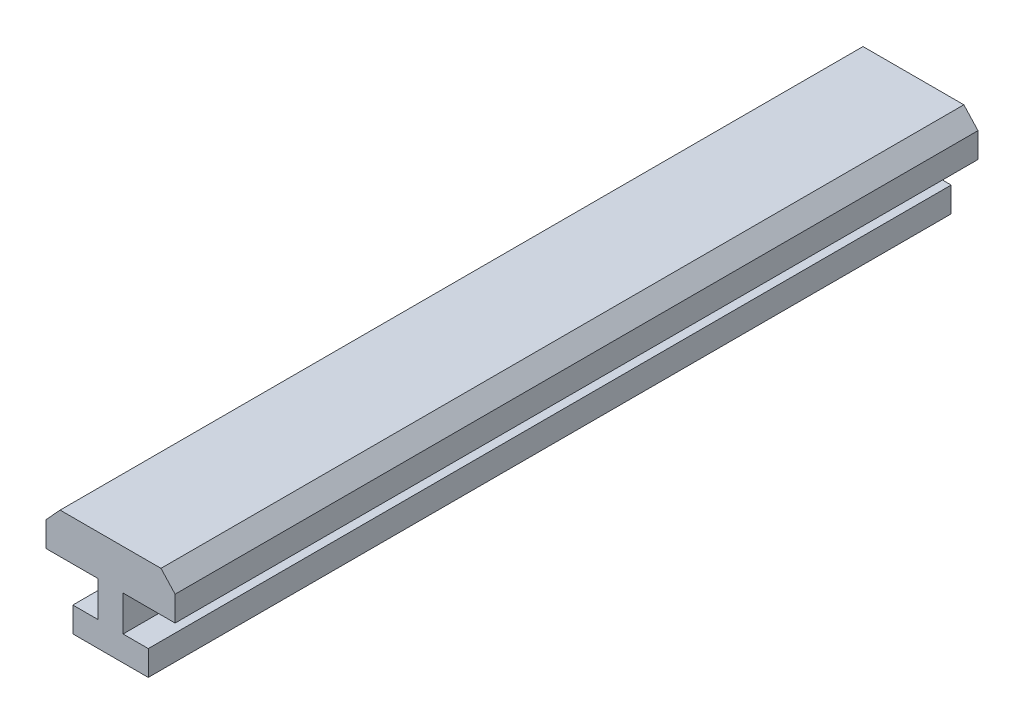
ISO-10303-21;
HEADER;
FILE_DESCRIPTION(('STEP AP214'),'2;1');
FILE_NAME('part.step','',(''),(''),'','','');
FILE_SCHEMA(('AUTOMOTIVE_DESIGN { 1 0 10303 214 1 1 1 1 }'));
ENDSEC;
DATA;
#1=APPLICATION_CONTEXT('core data for automotive mechanical design processes');
#2=APPLICATION_PROTOCOL_DEFINITION('international standard','automotive_design',2000,#1);
#3=PRODUCT_CONTEXT('',#1,'mechanical');
#4=PRODUCT('Part','Part','',(#3));
#5=PRODUCT_RELATED_PRODUCT_CATEGORY('part','',(#4));
#6=PRODUCT_DEFINITION_FORMATION('','',#4);
#7=PRODUCT_DEFINITION_CONTEXT('part definition',#1,'design');
#8=PRODUCT_DEFINITION('design','',#6,#7);
#9=PRODUCT_DEFINITION_SHAPE('','',#8);
#10=(LENGTH_UNIT() NAMED_UNIT(*) SI_UNIT(.MILLI.,.METRE.));
#11=(NAMED_UNIT(*) PLANE_ANGLE_UNIT() SI_UNIT($,.RADIAN.));
#12=(NAMED_UNIT(*) SI_UNIT($,.STERADIAN.) SOLID_ANGLE_UNIT());
#13=UNCERTAINTY_MEASURE_WITH_UNIT(LENGTH_MEASURE(1.E-05),#10,'distance_accuracy_value','');
#14=(GEOMETRIC_REPRESENTATION_CONTEXT(3) GLOBAL_UNCERTAINTY_ASSIGNED_CONTEXT((#13)) GLOBAL_UNIT_ASSIGNED_CONTEXT((#10,
#11,#12)) REPRESENTATION_CONTEXT('',''));
#15=CARTESIAN_POINT('',(0.,0.,0.));
#16=DIRECTION('',(0.,0.,1.));
#17=DIRECTION('',(1.,0.,0.));
#18=AXIS2_PLACEMENT_3D('',#15,#16,#17);
#19=CARTESIAN_POINT('',(1.77,0.,-19.9));
#20=DIRECTION('',(1.,0.,0.));
#21=DIRECTION('',(0.,0.,-1.));
#22=AXIS2_PLACEMENT_3D('',#19,#20,#21);
#23=PLANE('',#22);
#24=DIRECTION('',(0.,0.,-1.));
#25=VECTOR('',#24,1.);
#26=CARTESIAN_POINT('',(1.77,0.,-19.9));
#27=LINE('',#26,#25);
#28=CARTESIAN_POINT('',(1.77,0.,-19.9));
#29=VERTEX_POINT('',#28);
#30=CARTESIAN_POINT('',(1.77,0.,19.9));
#31=VERTEX_POINT('',#30);
#32=EDGE_CURVE('E171',#29,#31,#27,.F.);
#33=ORIENTED_EDGE('',*,*,#32,.F.);
#34=DIRECTION('',(0.,1.,0.));
#35=VECTOR('',#34,1.);
#36=CARTESIAN_POINT('',(1.77,0.,-19.9));
#37=LINE('',#36,#35);
#38=CARTESIAN_POINT('',(1.77,1.24,-19.9));
#39=VERTEX_POINT('',#38);
#40=EDGE_CURVE('E113',#29,#39,#37,.T.);
#41=ORIENTED_EDGE('',*,*,#40,.T.);
#42=DIRECTION('',(0.,0.,1.));
#43=VECTOR('',#42,1.);
#44=CARTESIAN_POINT('',(1.77,1.24,-19.9));
#45=LINE('',#44,#43);
#46=CARTESIAN_POINT('',(1.77,1.24,19.9));
#47=VERTEX_POINT('',#46);
#48=EDGE_CURVE('E128',#47,#39,#45,.F.);
#49=ORIENTED_EDGE('',*,*,#48,.F.);
#50=DIRECTION('',(0.,1.,0.));
#51=VECTOR('',#50,1.);
#52=CARTESIAN_POINT('',(1.77,0.,19.9));
#53=LINE('',#52,#51);
#54=EDGE_CURVE('E17',#47,#31,#53,.F.);
#55=ORIENTED_EDGE('',*,*,#54,.T.);
#56=EDGE_LOOP('',(#33,#41,#49,#55));
#57=FACE_BOUND('',#56,.T.);
#58=ADVANCED_FACE('F14',(#57),#23,.T.);
#59=CARTESIAN_POINT('',(-1.97,1.24,-19.9));
#60=DIRECTION('',(-1.,0.,0.));
#61=DIRECTION('',(0.,0.,1.));
#62=AXIS2_PLACEMENT_3D('',#59,#60,#61);
#63=PLANE('',#62);
#64=DIRECTION('',(0.,0.,1.));
#65=VECTOR('',#64,1.);
#66=CARTESIAN_POINT('',(-1.97,1.24,-19.9));
#67=LINE('',#66,#65);
#68=CARTESIAN_POINT('',(-1.97,1.24,-19.9));
#69=VERTEX_POINT('',#68);
#70=CARTESIAN_POINT('',(-1.97,1.24,19.9));
#71=VERTEX_POINT('',#70);
#72=EDGE_CURVE('E147',#69,#71,#67,.T.);
#73=ORIENTED_EDGE('',*,*,#72,.F.);
#74=DIRECTION('',(0.,1.,0.));
#75=VECTOR('',#74,1.);
#76=CARTESIAN_POINT('',(-1.97,1.24,-19.9));
#77=LINE('',#76,#75);
#78=CARTESIAN_POINT('',(-1.97,0.,-19.9));
#79=VERTEX_POINT('',#78);
#80=EDGE_CURVE('E136',#69,#79,#77,.F.);
#81=ORIENTED_EDGE('',*,*,#80,.T.);
#82=DIRECTION('',(0.,0.,-1.));
#83=VECTOR('',#82,1.);
#84=CARTESIAN_POINT('',(-1.97,0.,-19.9));
#85=LINE('',#84,#83);
#86=CARTESIAN_POINT('',(-1.97,0.,19.9));
#87=VERTEX_POINT('',#86);
#88=EDGE_CURVE('E150',#87,#79,#85,.T.);
#89=ORIENTED_EDGE('',*,*,#88,.F.);
#90=DIRECTION('',(0.,1.,0.));
#91=VECTOR('',#90,1.);
#92=CARTESIAN_POINT('',(-1.97,1.24,19.9));
#93=LINE('',#92,#91);
#94=EDGE_CURVE('E138',#87,#71,#93,.T.);
#95=ORIENTED_EDGE('',*,*,#94,.T.);
#96=EDGE_LOOP('',(#73,#81,#89,#95));
#97=FACE_BOUND('',#96,.T.);
#98=ADVANCED_FACE('F145',(#97),#63,.T.);
#99=CARTESIAN_POINT('',(1.77,1.24,-19.9));
#100=DIRECTION('',(0.,1.,0.));
#101=DIRECTION('',(0.,0.,1.));
#102=AXIS2_PLACEMENT_3D('',#99,#100,#101);
#103=PLANE('',#102);
#104=ORIENTED_EDGE('',*,*,#48,.T.);
#105=DIRECTION('',(1.,0.,0.));
#106=VECTOR('',#105,1.);
#107=CARTESIAN_POINT('',(1.77,1.24,-19.9));
#108=LINE('',#107,#106);
#109=CARTESIAN_POINT('',(0.519999999999997,1.24,-19.9));
#110=VERTEX_POINT('',#109);
#111=EDGE_CURVE('E130',#39,#110,#108,.F.);
#112=ORIENTED_EDGE('',*,*,#111,.T.);
#113=DIRECTION('',(0.,0.,-1.));
#114=VECTOR('',#113,1.);
#115=CARTESIAN_POINT('',(0.519999999999998,1.24,-19.9));
#116=LINE('',#115,#114);
#117=CARTESIAN_POINT('',(0.519999999999997,1.24,19.9));
#118=VERTEX_POINT('',#117);
#119=EDGE_CURVE('E134',#118,#110,#116,.T.);
#120=ORIENTED_EDGE('',*,*,#119,.F.);
#121=DIRECTION('',(1.,0.,0.));
#122=VECTOR('',#121,1.);
#123=CARTESIAN_POINT('',(1.77,1.24,19.9));
#124=LINE('',#123,#122);
#125=EDGE_CURVE('E122',#118,#47,#124,.T.);
#126=ORIENTED_EDGE('',*,*,#125,.T.);
#127=EDGE_LOOP('',(#104,#112,#120,#126));
#128=FACE_BOUND('',#127,.T.);
#129=ADVANCED_FACE('F132',(#128),#103,.T.);
#130=CARTESIAN_POINT('',(-0.72,1.24,-19.9));
#131=DIRECTION('',(0.,1.,0.));
#132=DIRECTION('',(0.,0.,1.));
#133=AXIS2_PLACEMENT_3D('',#130,#131,#132);
#134=PLANE('',#133);
#135=DIRECTION('',(0.,0.,1.));
#136=VECTOR('',#135,1.);
#137=CARTESIAN_POINT('',(-0.72,1.24,-19.9));
#138=LINE('',#137,#136);
#139=CARTESIAN_POINT('',(-0.72,1.24,-19.9));
#140=VERTEX_POINT('',#139);
#141=CARTESIAN_POINT('',(-0.72,1.24,19.9));
#142=VERTEX_POINT('',#141);
#143=EDGE_CURVE('E183',#140,#142,#138,.T.);
#144=ORIENTED_EDGE('',*,*,#143,.F.);
#145=DIRECTION('',(1.,0.,0.));
#146=VECTOR('',#145,1.);
#147=CARTESIAN_POINT('',(-0.72,1.24,-19.9));
#148=LINE('',#147,#146);
#149=EDGE_CURVE('E159',#140,#69,#148,.F.);
#150=ORIENTED_EDGE('',*,*,#149,.T.);
#151=ORIENTED_EDGE('',*,*,#72,.T.);
#152=DIRECTION('',(1.,0.,0.));
#153=VECTOR('',#152,1.);
#154=CARTESIAN_POINT('',(-0.72,1.24,19.9));
#155=LINE('',#154,#153);
#156=EDGE_CURVE('E152',#71,#142,#155,.T.);
#157=ORIENTED_EDGE('',*,*,#156,.T.);
#158=EDGE_LOOP('',(#144,#150,#151,#157));
#159=FACE_BOUND('',#158,.T.);
#160=ADVANCED_FACE('F161',(#159),#134,.T.);
#161=CARTESIAN_POINT('',(-3.3,4.24000000000002,-19.9));
#162=DIRECTION('',(-1.,0.,0.));
#163=DIRECTION('',(0.,-1.,0.));
#164=AXIS2_PLACEMENT_3D('',#161,#162,#163);
#165=PLANE('',#164);
#166=DIRECTION('',(0.,0.,1.));
#167=VECTOR('',#166,1.);
#168=CARTESIAN_POINT('',(-3.3,4.24000000000002,-19.9));
#169=LINE('',#168,#167);
#170=CARTESIAN_POINT('',(-3.3,4.24000000000001,-19.9));
#171=VERTEX_POINT('',#170);
#172=CARTESIAN_POINT('',(-3.3,4.24000000000001,19.9));
#173=VERTEX_POINT('',#172);
#174=EDGE_CURVE('E188',#171,#173,#169,.T.);
#175=ORIENTED_EDGE('',*,*,#174,.F.);
#176=DIRECTION('',(0.,-1.,0.));
#177=VECTOR('',#176,1.);
#178=CARTESIAN_POINT('',(-3.3,4.24000000000002,-19.9));
#179=LINE('',#178,#177);
#180=CARTESIAN_POINT('',(-3.3,3.,-19.9));
#181=VERTEX_POINT('',#180);
#182=EDGE_CURVE('E167',#171,#181,#179,.T.);
#183=ORIENTED_EDGE('',*,*,#182,.T.);
#184=DIRECTION('',(0.,0.,-1.));
#185=VECTOR('',#184,1.);
#186=CARTESIAN_POINT('',(-3.3,3.,-19.9));
#187=LINE('',#186,#185);
#188=CARTESIAN_POINT('',(-3.3,3.,19.9));
#189=VERTEX_POINT('',#188);
#190=EDGE_CURVE('E180',#189,#181,#187,.T.);
#191=ORIENTED_EDGE('',*,*,#190,.F.);
#192=DIRECTION('',(0.,-1.,0.));
#193=VECTOR('',#192,1.);
#194=CARTESIAN_POINT('',(-3.3,4.24000000000002,19.9));
#195=LINE('',#194,#193);
#196=EDGE_CURVE('E165',#189,#173,#195,.F.);
#197=ORIENTED_EDGE('',*,*,#196,.T.);
#198=EDGE_LOOP('',(#175,#183,#191,#197));
#199=FACE_BOUND('',#198,.T.);
#200=ADVANCED_FACE('F257',(#199),#165,.T.);
#201=CARTESIAN_POINT('',(3.1,3.,-19.9));
#202=DIRECTION('',(1.,0.,0.));
#203=DIRECTION('',(0.,1.,0.));
#204=AXIS2_PLACEMENT_3D('',#201,#202,#203);
#205=PLANE('',#204);
#206=DIRECTION('',(0.,0.,1.));
#207=VECTOR('',#206,1.);
#208=CARTESIAN_POINT('',(3.1,3.,-19.9));
#209=LINE('',#208,#207);
#210=CARTESIAN_POINT('',(3.1,3.,-19.9));
#211=VERTEX_POINT('',#210);
#212=CARTESIAN_POINT('',(3.1,3.,19.9));
#213=VERTEX_POINT('',#212);
#214=EDGE_CURVE('E175',#211,#213,#209,.T.);
#215=ORIENTED_EDGE('',*,*,#214,.F.);
#216=DIRECTION('',(0.,1.,0.));
#217=VECTOR('',#216,1.);
#218=CARTESIAN_POINT('',(3.1,3.,-19.9));
#219=LINE('',#218,#217);
#220=CARTESIAN_POINT('',(3.1,4.24000000000001,-19.9));
#221=VERTEX_POINT('',#220);
#222=EDGE_CURVE('E169',#211,#221,#219,.T.);
#223=ORIENTED_EDGE('',*,*,#222,.T.);
#224=DIRECTION('',(0.,0.,1.));
#225=VECTOR('',#224,1.);
#226=CARTESIAN_POINT('',(3.1,4.24000000000001,-19.9));
#227=LINE('',#226,#225);
#228=CARTESIAN_POINT('',(3.1,4.24000000000001,19.9));
#229=VERTEX_POINT('',#228);
#230=EDGE_CURVE('E208',#229,#221,#227,.F.);
#231=ORIENTED_EDGE('',*,*,#230,.F.);
#232=DIRECTION('',(0.,1.,0.));
#233=VECTOR('',#232,1.);
#234=CARTESIAN_POINT('',(3.1,0.,19.9));
#235=LINE('',#234,#233);
#236=EDGE_CURVE('E197',#213,#229,#235,.T.);
#237=ORIENTED_EDGE('',*,*,#236,.F.);
#238=EDGE_LOOP('',(#215,#223,#231,#237));
#239=FACE_BOUND('',#238,.T.);
#240=ADVANCED_FACE('F243',(#239),#205,.T.);
#241=CARTESIAN_POINT('',(-1.97,0.,-19.9));
#242=DIRECTION('',(0.,-1.,0.));
#243=DIRECTION('',(0.,0.,-1.));
#244=AXIS2_PLACEMENT_3D('',#241,#242,#243);
#245=PLANE('',#244);
#246=ORIENTED_EDGE('',*,*,#88,.T.);
#247=DIRECTION('',(1.,0.,0.));
#248=VECTOR('',#247,1.);
#249=CARTESIAN_POINT('',(0.,0.,-19.9));
#250=LINE('',#249,#248);
#251=EDGE_CURVE('E210',#79,#29,#250,.T.);
#252=ORIENTED_EDGE('',*,*,#251,.T.);
#253=ORIENTED_EDGE('',*,*,#32,.T.);
#254=DIRECTION('',(1.,0.,0.));
#255=VECTOR('',#254,1.);
#256=CARTESIAN_POINT('',(0.,0.,19.9));
#257=LINE('',#256,#255);
#258=EDGE_CURVE('E125',#87,#31,#257,.T.);
#259=ORIENTED_EDGE('',*,*,#258,.F.);
#260=EDGE_LOOP('',(#246,#252,#253,#259));
#261=FACE_BOUND('',#260,.T.);
#262=ADVANCED_FACE('F264',(#261),#245,.T.);
#263=CARTESIAN_POINT('',(0.519999999999998,1.24,-19.9));
#264=DIRECTION('',(1.,0.,0.));
#265=DIRECTION('',(0.,0.,-1.));
#266=AXIS2_PLACEMENT_3D('',#263,#264,#265);
#267=PLANE('',#266);
#268=ORIENTED_EDGE('',*,*,#119,.T.);
#269=DIRECTION('',(0.,1.,0.));
#270=VECTOR('',#269,1.);
#271=CARTESIAN_POINT('',(0.519999999999998,0.,-19.9));
#272=LINE('',#271,#270);
#273=CARTESIAN_POINT('',(0.519999999999997,3.,-19.9));
#274=VERTEX_POINT('',#273);
#275=EDGE_CURVE('E213',#110,#274,#272,.T.);
#276=ORIENTED_EDGE('',*,*,#275,.T.);
#277=DIRECTION('',(0.,0.,1.));
#278=VECTOR('',#277,1.);
#279=CARTESIAN_POINT('',(0.519999999999997,3.,-19.9));
#280=LINE('',#279,#278);
#281=CARTESIAN_POINT('',(0.519999999999997,3.,19.9));
#282=VERTEX_POINT('',#281);
#283=EDGE_CURVE('E177',#282,#274,#280,.F.);
#284=ORIENTED_EDGE('',*,*,#283,.F.);
#285=DIRECTION('',(0.,1.,0.));
#286=VECTOR('',#285,1.);
#287=CARTESIAN_POINT('',(0.519999999999998,0.,19.9));
#288=LINE('',#287,#286);
#289=EDGE_CURVE('E192',#118,#282,#288,.T.);
#290=ORIENTED_EDGE('',*,*,#289,.F.);
#291=EDGE_LOOP('',(#268,#276,#284,#290));
#292=FACE_BOUND('',#291,.T.);
#293=ADVANCED_FACE('F266',(#292),#267,.T.);
#294=CARTESIAN_POINT('',(0.519999999999998,3.,-19.9));
#295=DIRECTION('',(0.,-1.,0.));
#296=DIRECTION('',(1.,0.,0.));
#297=AXIS2_PLACEMENT_3D('',#294,#295,#296);
#298=PLANE('',#297);
#299=ORIENTED_EDGE('',*,*,#283,.T.);
#300=DIRECTION('',(1.,0.,0.));
#301=VECTOR('',#300,1.);
#302=CARTESIAN_POINT('',(0.,3.,-19.9));
#303=LINE('',#302,#301);
#304=EDGE_CURVE('E215',#274,#211,#303,.T.);
#305=ORIENTED_EDGE('',*,*,#304,.T.);
#306=ORIENTED_EDGE('',*,*,#214,.T.);
#307=DIRECTION('',(1.,0.,0.));
#308=VECTOR('',#307,1.);
#309=CARTESIAN_POINT('',(0.,3.,19.9));
#310=LINE('',#309,#308);
#311=EDGE_CURVE('E194',#282,#213,#310,.T.);
#312=ORIENTED_EDGE('',*,*,#311,.F.);
#313=EDGE_LOOP('',(#299,#305,#306,#312));
#314=FACE_BOUND('',#313,.T.);
#315=ADVANCED_FACE('F273',(#314),#298,.T.);
#316=CARTESIAN_POINT('',(-3.3,3.,-19.9));
#317=DIRECTION('',(0.,-1.,0.));
#318=DIRECTION('',(0.,0.,-1.));
#319=AXIS2_PLACEMENT_3D('',#316,#317,#318);
#320=PLANE('',#319);
#321=ORIENTED_EDGE('',*,*,#190,.T.);
#322=DIRECTION('',(1.,0.,0.));
#323=VECTOR('',#322,1.);
#324=CARTESIAN_POINT('',(0.,3.,-19.9));
#325=LINE('',#324,#323);
#326=CARTESIAN_POINT('',(-0.72,3.,-19.9));
#327=VERTEX_POINT('',#326);
#328=EDGE_CURVE('E222',#181,#327,#325,.T.);
#329=ORIENTED_EDGE('',*,*,#328,.T.);
#330=DIRECTION('',(0.,0.,1.));
#331=VECTOR('',#330,1.);
#332=CARTESIAN_POINT('',(-0.72,3.,-19.9));
#333=LINE('',#332,#331);
#334=CARTESIAN_POINT('',(-0.72,3.,19.9));
#335=VERTEX_POINT('',#334);
#336=EDGE_CURVE('E185',#335,#327,#333,.F.);
#337=ORIENTED_EDGE('',*,*,#336,.F.);
#338=DIRECTION('',(1.,0.,0.));
#339=VECTOR('',#338,1.);
#340=CARTESIAN_POINT('',(0.,3.,19.9));
#341=LINE('',#340,#339);
#342=EDGE_CURVE('E202',#189,#335,#341,.T.);
#343=ORIENTED_EDGE('',*,*,#342,.F.);
#344=EDGE_LOOP('',(#321,#329,#337,#343));
#345=FACE_BOUND('',#344,.T.);
#346=ADVANCED_FACE('F259',(#345),#320,.T.);
#347=CARTESIAN_POINT('',(-0.72,3.,-19.9));
#348=DIRECTION('',(-1.,0.,0.));
#349=DIRECTION('',(0.,-1.,0.));
#350=AXIS2_PLACEMENT_3D('',#347,#348,#349);
#351=PLANE('',#350);
#352=ORIENTED_EDGE('',*,*,#336,.T.);
#353=DIRECTION('',(0.,1.,0.));
#354=VECTOR('',#353,1.);
#355=CARTESIAN_POINT('',(-0.72,0.,-19.9));
#356=LINE('',#355,#354);
#357=EDGE_CURVE('E224',#327,#140,#356,.F.);
#358=ORIENTED_EDGE('',*,*,#357,.T.);
#359=ORIENTED_EDGE('',*,*,#143,.T.);
#360=DIRECTION('',(0.,1.,0.));
#361=VECTOR('',#360,1.);
#362=CARTESIAN_POINT('',(-0.72,0.,19.9));
#363=LINE('',#362,#361);
#364=EDGE_CURVE('E155',#335,#142,#363,.F.);
#365=ORIENTED_EDGE('',*,*,#364,.F.);
#366=EDGE_LOOP('',(#352,#358,#359,#365));
#367=FACE_BOUND('',#366,.T.);
#368=ADVANCED_FACE('F261',(#367),#351,.T.);
#369=CARTESIAN_POINT('',(-2.6,5.00000000000002,-19.9));
#370=DIRECTION('',(-0.735545105159089,0.677475754751788,0.));
#371=DIRECTION('',(-0.677475754751788,-0.735545105159089,0.));
#372=AXIS2_PLACEMENT_3D('',#369,#370,#371);
#373=PLANE('',#372);
#374=DIRECTION('',(0.,0.,1.));
#375=VECTOR('',#374,1.);
#376=CARTESIAN_POINT('',(-2.6,5.00000000000002,-19.9));
#377=LINE('',#376,#375);
#378=CARTESIAN_POINT('',(-2.60000000000001,5.00000000000002,-19.9));
#379=VERTEX_POINT('',#378);
#380=CARTESIAN_POINT('',(-2.60000000000001,5.00000000000002,19.9));
#381=VERTEX_POINT('',#380);
#382=EDGE_CURVE('E227',#379,#381,#377,.T.);
#383=ORIENTED_EDGE('',*,*,#382,.F.);
#384=DIRECTION('',(-0.677475754751788,-0.735545105159089,0.));
#385=VECTOR('',#384,1.);
#386=CARTESIAN_POINT('',(-2.6,5.00000000000002,-19.9));
#387=LINE('',#386,#385);
#388=EDGE_CURVE('E219',#379,#171,#387,.T.);
#389=ORIENTED_EDGE('',*,*,#388,.T.);
#390=ORIENTED_EDGE('',*,*,#174,.T.);
#391=DIRECTION('',(-0.677475754751788,-0.735545105159089,0.));
#392=VECTOR('',#391,1.);
#393=CARTESIAN_POINT('',(-2.6,5.00000000000002,19.9));
#394=LINE('',#393,#392);
#395=EDGE_CURVE('E199',#381,#173,#394,.T.);
#396=ORIENTED_EDGE('',*,*,#395,.F.);
#397=EDGE_LOOP('',(#383,#389,#390,#396));
#398=FACE_BOUND('',#397,.T.);
#399=ADVANCED_FACE('F253',(#398),#373,.T.);
#400=CARTESIAN_POINT('',(0.,0.,19.9));
#401=DIRECTION('',(0.,0.,1.));
#402=DIRECTION('',(1.,0.,0.));
#403=AXIS2_PLACEMENT_3D('',#400,#401,#402);
#404=PLANE('',#403);
#405=ORIENTED_EDGE('',*,*,#156,.F.);
#406=ORIENTED_EDGE('',*,*,#94,.F.);
#407=ORIENTED_EDGE('',*,*,#258,.T.);
#408=ORIENTED_EDGE('',*,*,#54,.F.);
#409=ORIENTED_EDGE('',*,*,#125,.F.);
#410=ORIENTED_EDGE('',*,*,#289,.T.);
#411=ORIENTED_EDGE('',*,*,#311,.T.);
#412=ORIENTED_EDGE('',*,*,#236,.T.);
#413=DIRECTION('',(-0.677475754751795,0.735545105159083,0.));
#414=VECTOR('',#413,1.);
#415=CARTESIAN_POINT('',(3.1,4.24000000000001,19.9));
#416=LINE('',#415,#414);
#417=CARTESIAN_POINT('',(2.4,5.,19.9));
#418=VERTEX_POINT('',#417);
#419=EDGE_CURVE('E205',#418,#229,#416,.F.);
#420=ORIENTED_EDGE('',*,*,#419,.F.);
#421=DIRECTION('',(-1.,0.,0.));
#422=VECTOR('',#421,1.);
#423=CARTESIAN_POINT('',(2.4,5.,19.9));
#424=LINE('',#423,#422);
#425=EDGE_CURVE('E230',#381,#418,#424,.F.);
#426=ORIENTED_EDGE('',*,*,#425,.F.);
#427=ORIENTED_EDGE('',*,*,#395,.T.);
#428=ORIENTED_EDGE('',*,*,#196,.F.);
#429=ORIENTED_EDGE('',*,*,#342,.T.);
#430=ORIENTED_EDGE('',*,*,#364,.T.);
#431=EDGE_LOOP('',(#405,#406,#407,#408,#409,#410,#411,#412,#420,#426,#427,#428,#429,#430));
#432=FACE_BOUND('',#431,.T.);
#433=ADVANCED_FACE('F119',(#432),#404,.T.);
#434=CARTESIAN_POINT('',(3.1,4.24000000000001,-19.9));
#435=DIRECTION('',(0.735545105159083,0.677475754751795,0.));
#436=DIRECTION('',(-0.677475754751795,0.735545105159083,0.));
#437=AXIS2_PLACEMENT_3D('',#434,#435,#436);
#438=PLANE('',#437);
#439=ORIENTED_EDGE('',*,*,#230,.T.);
#440=DIRECTION('',(-0.677475754751797,0.735545105159081,0.));
#441=VECTOR('',#440,1.);
#442=CARTESIAN_POINT('',(3.1,4.24000000000001,-19.9));
#443=LINE('',#442,#441);
#444=CARTESIAN_POINT('',(2.4,5.,-19.9));
#445=VERTEX_POINT('',#444);
#446=EDGE_CURVE('E32',#221,#445,#443,.T.);
#447=ORIENTED_EDGE('',*,*,#446,.T.);
#448=DIRECTION('',(0.,0.,1.));
#449=VECTOR('',#448,1.);
#450=CARTESIAN_POINT('',(2.4,5.,-19.9));
#451=LINE('',#450,#449);
#452=EDGE_CURVE('E23',#418,#445,#451,.F.);
#453=ORIENTED_EDGE('',*,*,#452,.F.);
#454=ORIENTED_EDGE('',*,*,#419,.T.);
#455=EDGE_LOOP('',(#439,#447,#453,#454));
#456=FACE_BOUND('',#455,.T.);
#457=ADVANCED_FACE('F237',(#456),#438,.T.);
#458=CARTESIAN_POINT('',(0.,0.,-19.9));
#459=DIRECTION('',(0.,0.,1.));
#460=DIRECTION('',(1.,0.,0.));
#461=AXIS2_PLACEMENT_3D('',#458,#459,#460);
#462=PLANE('',#461);
#463=ORIENTED_EDGE('',*,*,#357,.F.);
#464=ORIENTED_EDGE('',*,*,#328,.F.);
#465=ORIENTED_EDGE('',*,*,#182,.F.);
#466=ORIENTED_EDGE('',*,*,#388,.F.);
#467=DIRECTION('',(-1.,0.,0.));
#468=VECTOR('',#467,1.);
#469=CARTESIAN_POINT('',(2.4,5.,-19.9));
#470=LINE('',#469,#468);
#471=EDGE_CURVE('E9',#445,#379,#470,.T.);
#472=ORIENTED_EDGE('',*,*,#471,.F.);
#473=ORIENTED_EDGE('',*,*,#446,.F.);
#474=ORIENTED_EDGE('',*,*,#222,.F.);
#475=ORIENTED_EDGE('',*,*,#304,.F.);
#476=ORIENTED_EDGE('',*,*,#275,.F.);
#477=ORIENTED_EDGE('',*,*,#111,.F.);
#478=ORIENTED_EDGE('',*,*,#40,.F.);
#479=ORIENTED_EDGE('',*,*,#251,.F.);
#480=ORIENTED_EDGE('',*,*,#80,.F.);
#481=ORIENTED_EDGE('',*,*,#149,.F.);
#482=EDGE_LOOP('',(#463,#464,#465,#466,#472,#473,#474,#475,#476,#477,#478,#479,#480,#481));
#483=FACE_BOUND('',#482,.T.);
#484=ADVANCED_FACE('F247',(#483),#462,.F.);
#485=CARTESIAN_POINT('',(2.4,5.,-19.9));
#486=DIRECTION('',(0.,1.,0.));
#487=DIRECTION('',(-1.,0.,0.));
#488=AXIS2_PLACEMENT_3D('',#485,#486,#487);
#489=PLANE('',#488);
#490=ORIENTED_EDGE('',*,*,#452,.T.);
#491=ORIENTED_EDGE('',*,*,#471,.T.);
#492=ORIENTED_EDGE('',*,*,#382,.T.);
#493=ORIENTED_EDGE('',*,*,#425,.T.);
#494=EDGE_LOOP('',(#490,#491,#492,#493));
#495=FACE_BOUND('',#494,.T.);
#496=ADVANCED_FACE('F235',(#495),#489,.T.);
#497=CLOSED_SHELL('',(#58,#98,#129,#160,#200,#240,#262,#293,#315,#346,#368,#399,#433,#457,#484,#496));
#498=MANIFOLD_SOLID_BREP('B1',#497);
#499=ADVANCED_BREP_SHAPE_REPRESENTATION('',(#18,#498),#14);
#500=SHAPE_DEFINITION_REPRESENTATION(#9,#499);
ENDSEC;
END-ISO-10303-21;
